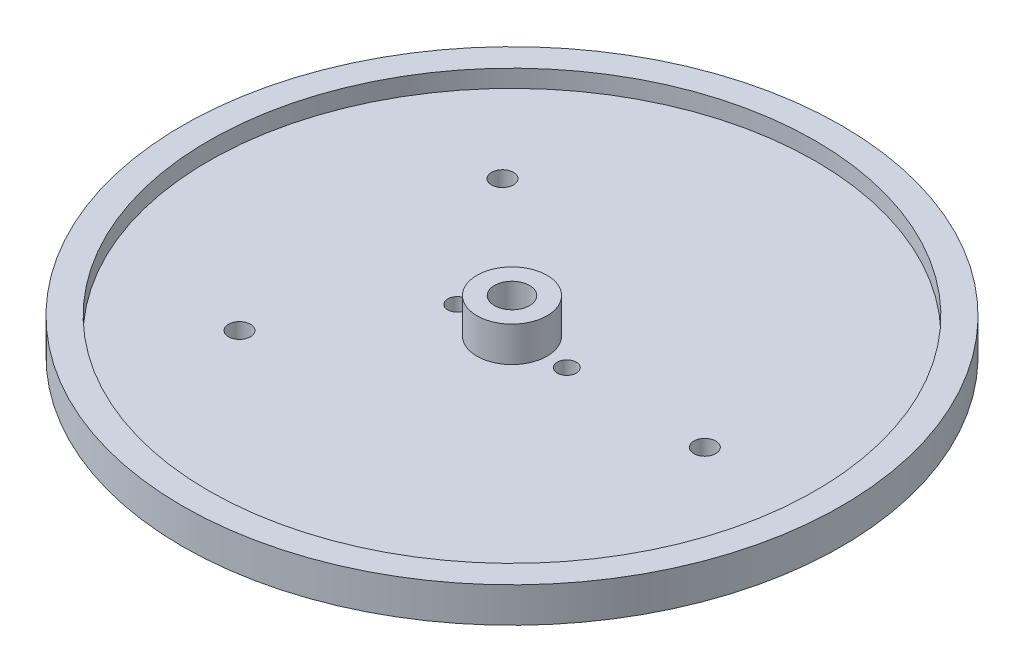
ISO-10303-21;
HEADER;
FILE_DESCRIPTION(('STEP AP214'),'2;1');
FILE_NAME('part.step','',(''),(''),'','','');
FILE_SCHEMA(('AUTOMOTIVE_DESIGN { 1 0 10303 214 1 1 1 1 }'));
ENDSEC;
DATA;
#1=APPLICATION_CONTEXT('core data for automotive mechanical design processes');
#2=APPLICATION_PROTOCOL_DEFINITION('international standard','automotive_design',2000,#1);
#3=PRODUCT_CONTEXT('',#1,'mechanical');
#4=PRODUCT('Part','Part','',(#3));
#5=PRODUCT_RELATED_PRODUCT_CATEGORY('part','',(#4));
#6=PRODUCT_DEFINITION_FORMATION('','',#4);
#7=PRODUCT_DEFINITION_CONTEXT('part definition',#1,'design');
#8=PRODUCT_DEFINITION('design','',#6,#7);
#9=PRODUCT_DEFINITION_SHAPE('','',#8);
#10=(LENGTH_UNIT() NAMED_UNIT(*) SI_UNIT(.MILLI.,.METRE.));
#11=(NAMED_UNIT(*) PLANE_ANGLE_UNIT() SI_UNIT($,.RADIAN.));
#12=(NAMED_UNIT(*) SI_UNIT($,.STERADIAN.) SOLID_ANGLE_UNIT());
#13=UNCERTAINTY_MEASURE_WITH_UNIT(LENGTH_MEASURE(1.E-05),#10,'distance_accuracy_value','');
#14=(GEOMETRIC_REPRESENTATION_CONTEXT(3) GLOBAL_UNCERTAINTY_ASSIGNED_CONTEXT((#13)) GLOBAL_UNIT_ASSIGNED_CONTEXT((#10,
#11,#12)) REPRESENTATION_CONTEXT('',''));
#15=CARTESIAN_POINT('',(0.,0.,0.));
#16=DIRECTION('',(0.,0.,1.));
#17=DIRECTION('',(1.,0.,0.));
#18=AXIS2_PLACEMENT_3D('',#15,#16,#17);
#19=CARTESIAN_POINT('',(0.,3.175,0.));
#20=DIRECTION('',(0.,1.,0.));
#21=DIRECTION('',(0.,0.,1.));
#22=AXIS2_PLACEMENT_3D('',#19,#20,#21);
#23=PLANE('',#22);
#24=CARTESIAN_POINT('',(0.,3.175,0.));
#25=DIRECTION('',(0.,1.,0.));
#26=DIRECTION('',(0.,0.,1.));
#27=AXIS2_PLACEMENT_3D('',#24,#25,#26);
#28=CIRCLE('',#27,54.9275);
#29=CARTESIAN_POINT('',(0.,3.175,54.9275));
#30=VERTEX_POINT('',#29);
#31=EDGE_CURVE('E10',#30,#30,#28,.F.);
#32=ORIENTED_EDGE('',*,*,#31,.F.);
#33=EDGE_LOOP('',(#32));
#34=FACE_BOUND('',#33,.T.);
#35=CARTESIAN_POINT('',(-25.5425280290495,3.175,-23.8187927251828));
#36=DIRECTION('',(0.,1.,0.));
#37=DIRECTION('',(0.,0.,1.));
#38=AXIS2_PLACEMENT_3D('',#35,#36,#37);
#39=CIRCLE('',#38,1.98437499999999);
#40=CARTESIAN_POINT('',(-25.5425280290495,3.175,-21.8344177251828));
#41=VERTEX_POINT('',#40);
#42=EDGE_CURVE('E384',#41,#41,#39,.T.);
#43=ORIENTED_EDGE('',*,*,#42,.F.);
#44=EDGE_LOOP('',(#43));
#45=FACE_BOUND('',#44,.T.);
#46=CARTESIAN_POINT('',(-25.5425280290496,3.175,23.8187927251827));
#47=DIRECTION('',(0.,1.,0.));
#48=DIRECTION('',(0.,0.,1.));
#49=AXIS2_PLACEMENT_3D('',#46,#47,#48);
#50=CIRCLE('',#49,1.98437499999999);
#51=CARTESIAN_POINT('',(-25.5425280290496,3.175,25.8031677251827));
#52=VERTEX_POINT('',#51);
#53=EDGE_CURVE('E390',#52,#52,#50,.T.);
#54=ORIENTED_EDGE('',*,*,#53,.F.);
#55=EDGE_LOOP('',(#54));
#56=FACE_BOUND('',#55,.T.);
#57=CARTESIAN_POINT('',(34.925,3.175,1.30104260698261E-13));
#58=DIRECTION('',(0.,1.,0.));
#59=DIRECTION('',(0.,0.,1.));
#60=AXIS2_PLACEMENT_3D('',#57,#58,#59);
#61=CIRCLE('',#60,1.984375);
#62=CARTESIAN_POINT('',(34.925,3.175,1.98437500000013));
#63=VERTEX_POINT('',#62);
#64=EDGE_CURVE('E396',#63,#63,#61,.T.);
#65=ORIENTED_EDGE('',*,*,#64,.F.);
#66=EDGE_LOOP('',(#65));
#67=FACE_BOUND('',#66,.T.);
#68=CARTESIAN_POINT('',(9.92187500000001,3.175,0.));
#69=DIRECTION('',(0.,1.,0.));
#70=DIRECTION('',(0.,0.,1.));
#71=AXIS2_PLACEMENT_3D('',#68,#69,#70);
#72=CIRCLE('',#71,1.7272);
#73=CARTESIAN_POINT('',(9.92187500000001,3.175,1.72719999999997));
#74=VERTEX_POINT('',#73);
#75=EDGE_CURVE('E402',#74,#74,#72,.T.);
#76=ORIENTED_EDGE('',*,*,#75,.F.);
#77=EDGE_LOOP('',(#76));
#78=FACE_BOUND('',#77,.T.);
#79=CARTESIAN_POINT('',(-9.921875,3.175,0.));
#80=DIRECTION('',(0.,1.,0.));
#81=DIRECTION('',(0.,0.,1.));
#82=AXIS2_PLACEMENT_3D('',#79,#80,#81);
#83=CIRCLE('',#82,1.7272);
#84=CARTESIAN_POINT('',(-9.921875,3.175,1.72720000000003));
#85=VERTEX_POINT('',#84);
#86=EDGE_CURVE('E408',#85,#85,#83,.T.);
#87=ORIENTED_EDGE('',*,*,#86,.F.);
#88=EDGE_LOOP('',(#87));
#89=FACE_BOUND('',#88,.T.);
#90=CARTESIAN_POINT('',(0.,3.175,0.));
#91=DIRECTION('',(0.,1.,0.));
#92=DIRECTION('',(0.,0.,1.));
#93=AXIS2_PLACEMENT_3D('',#90,#91,#92);
#94=CIRCLE('',#93,6.35);
#95=CARTESIAN_POINT('',(0.,3.175,6.35));
#96=VERTEX_POINT('',#95);
#97=EDGE_CURVE('E414',#96,#96,#94,.T.);
#98=ORIENTED_EDGE('',*,*,#97,.F.);
#99=EDGE_LOOP('',(#98));
#100=FACE_BOUND('',#99,.T.);
#101=ADVANCED_FACE('F358',(#34,#45,#56,#67,#78,#89,#100),#23,.T.);
#102=CARTESIAN_POINT('',(0.,0.,0.));
#103=DIRECTION('',(0.,1.,0.));
#104=DIRECTION('',(0.,0.,1.));
#105=AXIS2_PLACEMENT_3D('',#102,#103,#104);
#106=PLANE('',#105);
#107=CARTESIAN_POINT('',(-9.921875,0.,0.));
#108=DIRECTION('',(0.,1.,0.));
#109=DIRECTION('',(0.,0.,1.));
#110=AXIS2_PLACEMENT_3D('',#107,#108,#109);
#111=CIRCLE('',#110,1.7272);
#112=CARTESIAN_POINT('',(-9.921875,0.,1.72720000000003));
#113=VERTEX_POINT('',#112);
#114=EDGE_CURVE('E405',#113,#113,#111,.F.);
#115=ORIENTED_EDGE('',*,*,#114,.F.);
#116=EDGE_LOOP('',(#115));
#117=FACE_BOUND('',#116,.T.);
#118=CARTESIAN_POINT('',(9.92187500000001,0.,0.));
#119=DIRECTION('',(0.,1.,0.));
#120=DIRECTION('',(0.,0.,1.));
#121=AXIS2_PLACEMENT_3D('',#118,#119,#120);
#122=CIRCLE('',#121,1.7272);
#123=CARTESIAN_POINT('',(9.92187500000001,0.,1.72719999999997));
#124=VERTEX_POINT('',#123);
#125=EDGE_CURVE('E399',#124,#124,#122,.F.);
#126=ORIENTED_EDGE('',*,*,#125,.F.);
#127=EDGE_LOOP('',(#126));
#128=FACE_BOUND('',#127,.T.);
#129=CARTESIAN_POINT('',(34.925,0.,1.30104260698261E-13));
#130=DIRECTION('',(0.,1.,0.));
#131=DIRECTION('',(0.,0.,1.));
#132=AXIS2_PLACEMENT_3D('',#129,#130,#131);
#133=CIRCLE('',#132,1.984375);
#134=CARTESIAN_POINT('',(34.925,0.,1.98437500000013));
#135=VERTEX_POINT('',#134);
#136=EDGE_CURVE('E393',#135,#135,#133,.F.);
#137=ORIENTED_EDGE('',*,*,#136,.F.);
#138=EDGE_LOOP('',(#137));
#139=FACE_BOUND('',#138,.T.);
#140=CARTESIAN_POINT('',(-25.5425280290496,0.,23.8187927251827));
#141=DIRECTION('',(0.,1.,0.));
#142=DIRECTION('',(0.,0.,1.));
#143=AXIS2_PLACEMENT_3D('',#140,#141,#142);
#144=CIRCLE('',#143,1.98437499999999);
#145=CARTESIAN_POINT('',(-25.5425280290496,0.,25.8031677251827));
#146=VERTEX_POINT('',#145);
#147=EDGE_CURVE('E387',#146,#146,#144,.F.);
#148=ORIENTED_EDGE('',*,*,#147,.F.);
#149=EDGE_LOOP('',(#148));
#150=FACE_BOUND('',#149,.T.);
#151=CARTESIAN_POINT('',(-25.5425280290495,0.,-23.8187927251828));
#152=DIRECTION('',(0.,1.,0.));
#153=DIRECTION('',(0.,0.,1.));
#154=AXIS2_PLACEMENT_3D('',#151,#152,#153);
#155=CIRCLE('',#154,1.98437499999999);
#156=CARTESIAN_POINT('',(-25.5425280290495,0.,-21.8344177251828));
#157=VERTEX_POINT('',#156);
#158=EDGE_CURVE('E381',#157,#157,#155,.F.);
#159=ORIENTED_EDGE('',*,*,#158,.F.);
#160=EDGE_LOOP('',(#159));
#161=FACE_BOUND('',#160,.T.);
#162=CARTESIAN_POINT('',(0.,0.,0.));
#163=DIRECTION('',(0.,1.,0.));
#164=DIRECTION('',(0.,0.,1.));
#165=AXIS2_PLACEMENT_3D('',#162,#163,#164);
#166=CIRCLE('',#165,59.69);
#167=CARTESIAN_POINT('',(0.,0.,59.69));
#168=VERTEX_POINT('',#167);
#169=EDGE_CURVE('E365',#168,#168,#166,.T.);
#170=ORIENTED_EDGE('',*,*,#169,.F.);
#171=EDGE_LOOP('',(#170));
#172=FACE_BOUND('',#171,.T.);
#173=CARTESIAN_POINT('',(0.,0.,0.));
#174=DIRECTION('',(0.,1.,0.));
#175=DIRECTION('',(0.,0.,1.));
#176=AXIS2_PLACEMENT_3D('',#173,#174,#175);
#177=CIRCLE('',#176,3.175);
#178=CARTESIAN_POINT('',(0.,0.,3.175));
#179=VERTEX_POINT('',#178);
#180=EDGE_CURVE('E369',#179,#179,#177,.T.);
#181=ORIENTED_EDGE('',*,*,#180,.T.);
#182=EDGE_LOOP('',(#181));
#183=FACE_BOUND('',#182,.T.);
#184=ADVANCED_FACE('F440',(#117,#128,#139,#150,#161,#172,#183),#106,.F.);
#185=CARTESIAN_POINT('',(0.,3.175,0.));
#186=DIRECTION('',(0.,-1.,0.));
#187=DIRECTION('',(0.,0.,-1.));
#188=AXIS2_PLACEMENT_3D('',#185,#186,#187);
#189=CYLINDRICAL_SURFACE('',#188,59.69);
#190=ORIENTED_EDGE('',*,*,#169,.T.);
#191=EDGE_LOOP('',(#190));
#192=FACE_BOUND('',#191,.T.);
#193=CARTESIAN_POINT('',(0.,6.35,0.));
#194=DIRECTION('',(0.,1.,0.));
#195=DIRECTION('',(0.,0.,1.));
#196=AXIS2_PLACEMENT_3D('',#193,#194,#195);
#197=CIRCLE('',#196,59.69);
#198=CARTESIAN_POINT('',(0.,6.35,59.69));
#199=VERTEX_POINT('',#198);
#200=EDGE_CURVE('E373',#199,#199,#197,.T.);
#201=ORIENTED_EDGE('',*,*,#200,.F.);
#202=EDGE_LOOP('',(#201));
#203=FACE_BOUND('',#202,.T.);
#204=ADVANCED_FACE('F360',(#192,#203),#189,.T.);
#205=CARTESIAN_POINT('',(0.,3.175,0.));
#206=DIRECTION('',(0.,-1.,0.));
#207=DIRECTION('',(0.,0.,-1.));
#208=AXIS2_PLACEMENT_3D('',#205,#206,#207);
#209=CYLINDRICAL_SURFACE('',#208,3.175);
#210=ORIENTED_EDGE('',*,*,#180,.F.);
#211=EDGE_LOOP('',(#210));
#212=FACE_BOUND('',#211,.T.);
#213=CARTESIAN_POINT('',(0.,9.525,0.));
#214=DIRECTION('',(0.,1.,0.));
#215=DIRECTION('',(0.,0.,1.));
#216=AXIS2_PLACEMENT_3D('',#213,#214,#215);
#217=CIRCLE('',#216,3.175);
#218=CARTESIAN_POINT('',(0.,9.525,3.175));
#219=VERTEX_POINT('',#218);
#220=EDGE_CURVE('E417',#219,#219,#217,.T.);
#221=ORIENTED_EDGE('',*,*,#220,.T.);
#222=EDGE_LOOP('',(#221));
#223=FACE_BOUND('',#222,.T.);
#224=ADVANCED_FACE('F421',(#212,#223),#209,.F.);
#225=CARTESIAN_POINT('',(0.,6.35,0.));
#226=DIRECTION('',(0.,1.,0.));
#227=DIRECTION('',(0.,0.,1.));
#228=AXIS2_PLACEMENT_3D('',#225,#226,#227);
#229=PLANE('',#228);
#230=ORIENTED_EDGE('',*,*,#200,.T.);
#231=EDGE_LOOP('',(#230));
#232=FACE_BOUND('',#231,.T.);
#233=CARTESIAN_POINT('',(0.,6.35,0.));
#234=DIRECTION('',(0.,1.,0.));
#235=DIRECTION('',(0.,0.,1.));
#236=AXIS2_PLACEMENT_3D('',#233,#234,#235);
#237=CIRCLE('',#236,54.9275);
#238=CARTESIAN_POINT('',(0.,6.35,54.9275));
#239=VERTEX_POINT('',#238);
#240=EDGE_CURVE('E378',#239,#239,#237,.T.);
#241=ORIENTED_EDGE('',*,*,#240,.F.);
#242=EDGE_LOOP('',(#241));
#243=FACE_BOUND('',#242,.T.);
#244=ADVANCED_FACE('F450',(#232,#243),#229,.T.);
#245=CARTESIAN_POINT('',(0.,6.35,0.));
#246=DIRECTION('',(0.,-1.,0.));
#247=DIRECTION('',(0.,0.,-1.));
#248=AXIS2_PLACEMENT_3D('',#245,#246,#247);
#249=CYLINDRICAL_SURFACE('',#248,54.9275);
#250=ORIENTED_EDGE('',*,*,#240,.T.);
#251=EDGE_LOOP('',(#250));
#252=FACE_BOUND('',#251,.T.);
#253=ORIENTED_EDGE('',*,*,#31,.T.);
#254=EDGE_LOOP('',(#253));
#255=FACE_BOUND('',#254,.T.);
#256=ADVANCED_FACE('F454',(#252,#255),#249,.F.);
#257=CARTESIAN_POINT('',(-25.5425280290495,-0.00100000000000013,-23.8187927251828));
#258=DIRECTION('',(0.,1.,0.));
#259=DIRECTION('',(0.,0.,1.));
#260=AXIS2_PLACEMENT_3D('',#257,#258,#259);
#261=CYLINDRICAL_SURFACE('',#260,1.98437499999999);
#262=ORIENTED_EDGE('',*,*,#42,.T.);
#263=EDGE_LOOP('',(#262));
#264=FACE_BOUND('',#263,.T.);
#265=ORIENTED_EDGE('',*,*,#158,.T.);
#266=EDGE_LOOP('',(#265));
#267=FACE_BOUND('',#266,.T.);
#268=ADVANCED_FACE('F458',(#264,#267),#261,.F.);
#269=CARTESIAN_POINT('',(-25.5425280290496,-0.00100000000000013,23.8187927251827));
#270=DIRECTION('',(0.,1.,0.));
#271=DIRECTION('',(0.,0.,1.));
#272=AXIS2_PLACEMENT_3D('',#269,#270,#271);
#273=CYLINDRICAL_SURFACE('',#272,1.98437499999999);
#274=ORIENTED_EDGE('',*,*,#53,.T.);
#275=EDGE_LOOP('',(#274));
#276=FACE_BOUND('',#275,.T.);
#277=ORIENTED_EDGE('',*,*,#147,.T.);
#278=EDGE_LOOP('',(#277));
#279=FACE_BOUND('',#278,.T.);
#280=ADVANCED_FACE('F462',(#276,#279),#273,.F.);
#281=CARTESIAN_POINT('',(34.925,-0.00100000000000013,1.30104260698261E-13));
#282=DIRECTION('',(0.,1.,0.));
#283=DIRECTION('',(0.,0.,1.));
#284=AXIS2_PLACEMENT_3D('',#281,#282,#283);
#285=CYLINDRICAL_SURFACE('',#284,1.984375);
#286=ORIENTED_EDGE('',*,*,#64,.T.);
#287=EDGE_LOOP('',(#286));
#288=FACE_BOUND('',#287,.T.);
#289=ORIENTED_EDGE('',*,*,#136,.T.);
#290=EDGE_LOOP('',(#289));
#291=FACE_BOUND('',#290,.T.);
#292=ADVANCED_FACE('F466',(#288,#291),#285,.F.);
#293=CARTESIAN_POINT('',(9.92187500000001,-0.00100000000000013,0.));
#294=DIRECTION('',(0.,1.,0.));
#295=DIRECTION('',(0.,0.,1.));
#296=AXIS2_PLACEMENT_3D('',#293,#294,#295);
#297=CYLINDRICAL_SURFACE('',#296,1.7272);
#298=ORIENTED_EDGE('',*,*,#75,.T.);
#299=EDGE_LOOP('',(#298));
#300=FACE_BOUND('',#299,.T.);
#301=ORIENTED_EDGE('',*,*,#125,.T.);
#302=EDGE_LOOP('',(#301));
#303=FACE_BOUND('',#302,.T.);
#304=ADVANCED_FACE('F436',(#300,#303),#297,.F.);
#305=CARTESIAN_POINT('',(-9.921875,-0.00100000000000013,0.));
#306=DIRECTION('',(0.,1.,0.));
#307=DIRECTION('',(0.,0.,1.));
#308=AXIS2_PLACEMENT_3D('',#305,#306,#307);
#309=CYLINDRICAL_SURFACE('',#308,1.7272);
#310=ORIENTED_EDGE('',*,*,#86,.T.);
#311=EDGE_LOOP('',(#310));
#312=FACE_BOUND('',#311,.T.);
#313=ORIENTED_EDGE('',*,*,#114,.T.);
#314=EDGE_LOOP('',(#313));
#315=FACE_BOUND('',#314,.T.);
#316=ADVANCED_FACE('F426',(#312,#315),#309,.F.);
#317=CARTESIAN_POINT('',(0.,9.525,0.));
#318=DIRECTION('',(0.,1.,0.));
#319=DIRECTION('',(0.,0.,1.));
#320=AXIS2_PLACEMENT_3D('',#317,#318,#319);
#321=PLANE('',#320);
#322=CARTESIAN_POINT('',(0.,9.525,0.));
#323=DIRECTION('',(0.,1.,0.));
#324=DIRECTION('',(0.,0.,1.));
#325=AXIS2_PLACEMENT_3D('',#322,#323,#324);
#326=CIRCLE('',#325,6.35);
#327=CARTESIAN_POINT('',(0.,9.525,6.35));
#328=VERTEX_POINT('',#327);
#329=EDGE_CURVE('E411',#328,#328,#326,.T.);
#330=ORIENTED_EDGE('',*,*,#329,.T.);
#331=EDGE_LOOP('',(#330));
#332=FACE_BOUND('',#331,.T.);
#333=ORIENTED_EDGE('',*,*,#220,.F.);
#334=EDGE_LOOP('',(#333));
#335=FACE_BOUND('',#334,.T.);
#336=ADVANCED_FACE('F423',(#332,#335),#321,.T.);
#337=CARTESIAN_POINT('',(0.,9.525,0.));
#338=DIRECTION('',(0.,-1.,0.));
#339=DIRECTION('',(0.,0.,-1.));
#340=AXIS2_PLACEMENT_3D('',#337,#338,#339);
#341=CYLINDRICAL_SURFACE('',#340,6.35);
#342=ORIENTED_EDGE('',*,*,#329,.F.);
#343=EDGE_LOOP('',(#342));
#344=FACE_BOUND('',#343,.T.);
#345=ORIENTED_EDGE('',*,*,#97,.T.);
#346=EDGE_LOOP('',(#345));
#347=FACE_BOUND('',#346,.T.);
#348=ADVANCED_FACE('F425',(#344,#347),#341,.T.);
#349=CLOSED_SHELL('',(#101,#184,#204,#224,#244,#256,#268,#280,#292,#304,#316,#336,#348));
#350=MANIFOLD_SOLID_BREP('B2',#349);
#351=ADVANCED_BREP_SHAPE_REPRESENTATION('',(#18,#350),#14);
#352=SHAPE_DEFINITION_REPRESENTATION(#9,#351);
ENDSEC;
END-ISO-10303-21;
